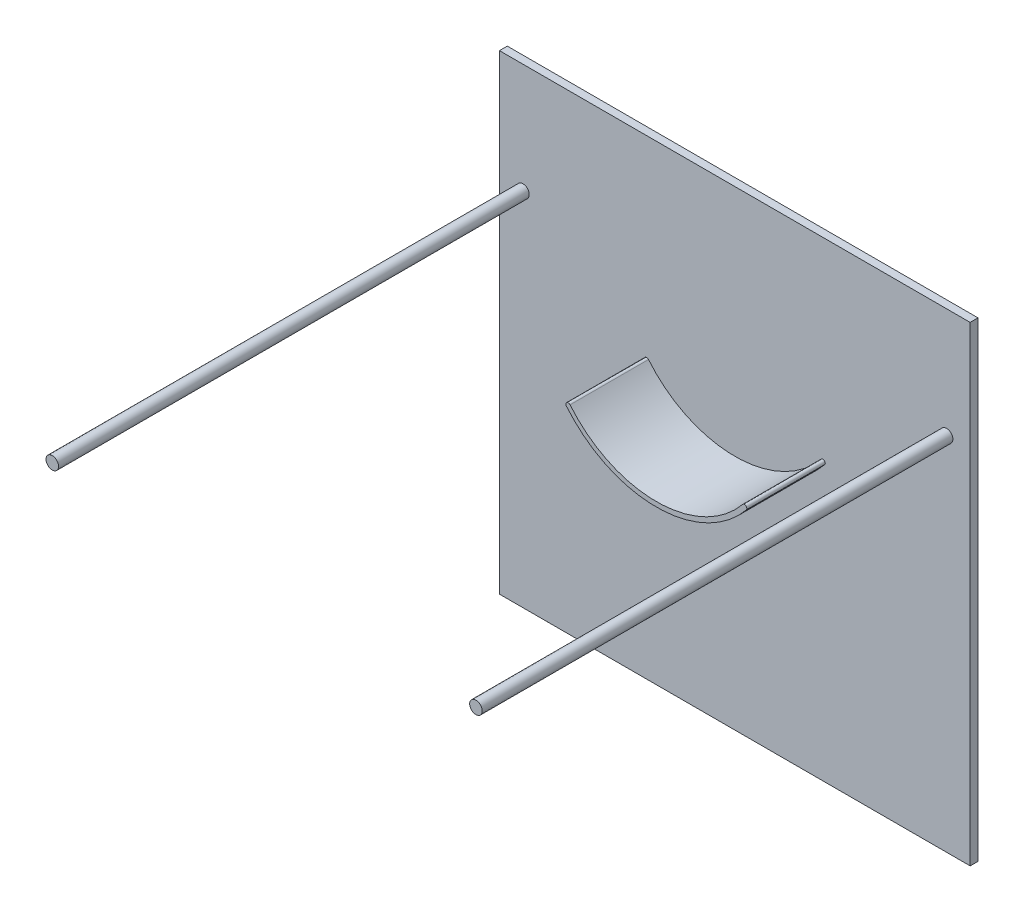
ISO-10303-21;
HEADER;
FILE_DESCRIPTION(('STEP AP214'),'2;1');
FILE_NAME('part.step','',(''),(''),'','','');
FILE_SCHEMA(('AUTOMOTIVE_DESIGN { 1 0 10303 214 1 1 1 1 }'));
ENDSEC;
DATA;
#1=APPLICATION_CONTEXT('core data for automotive mechanical design processes');
#2=APPLICATION_PROTOCOL_DEFINITION('international standard','automotive_design',2000,#1);
#3=PRODUCT_CONTEXT('',#1,'mechanical');
#4=PRODUCT('Part','Part','',(#3));
#5=PRODUCT_RELATED_PRODUCT_CATEGORY('part','',(#4));
#6=PRODUCT_DEFINITION_FORMATION('','',#4);
#7=PRODUCT_DEFINITION_CONTEXT('part definition',#1,'design');
#8=PRODUCT_DEFINITION('design','',#6,#7);
#9=PRODUCT_DEFINITION_SHAPE('','',#8);
#10=(LENGTH_UNIT() NAMED_UNIT(*) SI_UNIT(.MILLI.,.METRE.));
#11=(NAMED_UNIT(*) PLANE_ANGLE_UNIT() SI_UNIT($,.RADIAN.));
#12=(NAMED_UNIT(*) SI_UNIT($,.STERADIAN.) SOLID_ANGLE_UNIT());
#13=UNCERTAINTY_MEASURE_WITH_UNIT(LENGTH_MEASURE(1.E-05),#10,'distance_accuracy_value','');
#14=(GEOMETRIC_REPRESENTATION_CONTEXT(3) GLOBAL_UNCERTAINTY_ASSIGNED_CONTEXT((#13)) GLOBAL_UNIT_ASSIGNED_CONTEXT((#10,
#11,#12)) REPRESENTATION_CONTEXT('',''));
#15=CARTESIAN_POINT('',(0.,0.,0.));
#16=DIRECTION('',(0.,0.,1.));
#17=DIRECTION('',(1.,0.,0.));
#18=AXIS2_PLACEMENT_3D('',#15,#16,#17);
#19=CARTESIAN_POINT('',(0.,0.,5.));
#20=DIRECTION('',(0.,0.,1.));
#21=DIRECTION('',(1.,0.,0.));
#22=AXIS2_PLACEMENT_3D('',#19,#20,#21);
#23=PLANE('',#22);
#24=CARTESIAN_POINT('',(285.,-70.,5.));
#25=DIRECTION('',(0.,0.,1.));
#26=DIRECTION('',(-1.,0.,0.));
#27=AXIS2_PLACEMENT_3D('',#24,#25,#26);
#28=CIRCLE('',#27,4.00000000000005);
#29=CARTESIAN_POINT('',(281.,-70.,5.));
#30=VERTEX_POINT('',#29);
#31=EDGE_CURVE('E134',#30,#30,#28,.T.);
#32=ORIENTED_EDGE('',*,*,#31,.F.);
#33=EDGE_LOOP('',(#32));
#34=FACE_BOUND('',#33,.T.);
#35=CARTESIAN_POINT('',(15.,-70.,5.));
#36=DIRECTION('',(0.,0.,1.));
#37=DIRECTION('',(1.,0.,0.));
#38=AXIS2_PLACEMENT_3D('',#35,#36,#37);
#39=CIRCLE('',#38,4.);
#40=CARTESIAN_POINT('',(19.,-70.,5.));
#41=VERTEX_POINT('',#40);
#42=EDGE_CURVE('E143',#41,#41,#39,.T.);
#43=ORIENTED_EDGE('',*,*,#42,.F.);
#44=EDGE_LOOP('',(#43));
#45=FACE_BOUND('',#44,.T.);
#46=DIRECTION('',(0.,-1.,0.));
#47=VECTOR('',#46,1.);
#48=CARTESIAN_POINT('',(0.,0.,5.));
#49=LINE('',#48,#47);
#50=CARTESIAN_POINT('',(0.,0.,5.));
#51=VERTEX_POINT('',#50);
#52=CARTESIAN_POINT('',(0.,-300.,5.));
#53=VERTEX_POINT('',#52);
#54=EDGE_CURVE('E151',#51,#53,#49,.T.);
#55=ORIENTED_EDGE('',*,*,#54,.T.);
#56=DIRECTION('',(1.,0.,0.));
#57=VECTOR('',#56,1.);
#58=CARTESIAN_POINT('',(0.,-300.,5.));
#59=LINE('',#58,#57);
#60=CARTESIAN_POINT('',(300.,-300.,5.));
#61=VERTEX_POINT('',#60);
#62=EDGE_CURVE('E87',#53,#61,#59,.T.);
#63=ORIENTED_EDGE('',*,*,#62,.T.);
#64=DIRECTION('',(0.,1.,0.));
#65=VECTOR('',#64,1.);
#66=CARTESIAN_POINT('',(300.,0.,5.));
#67=LINE('',#66,#65);
#68=CARTESIAN_POINT('',(300.,0.,5.));
#69=VERTEX_POINT('',#68);
#70=EDGE_CURVE('E154',#61,#69,#67,.T.);
#71=ORIENTED_EDGE('',*,*,#70,.T.);
#72=DIRECTION('',(-1.,0.,0.));
#73=VECTOR('',#72,1.);
#74=CARTESIAN_POINT('',(0.,0.,5.));
#75=LINE('',#74,#73);
#76=EDGE_CURVE('E59',#69,#51,#75,.T.);
#77=ORIENTED_EDGE('',*,*,#76,.T.);
#78=EDGE_LOOP('',(#55,#63,#71,#77));
#79=FACE_BOUND('',#78,.T.);
#80=CARTESIAN_POINT('',(150.,-77.6237471765454,5.));
#81=DIRECTION('',(0.,0.,1.));
#82=DIRECTION('',(1.,0.,0.));
#83=AXIS2_PLACEMENT_3D('',#80,#81,#82);
#84=CIRCLE('',#83,74.2968250462832);
#85=CARTESIAN_POINT('',(92.6857314488704,-124.90051559833,5.));
#86=VERTEX_POINT('',#85);
#87=CARTESIAN_POINT('',(207.31426855113,-124.900515598329,5.));
#88=VERTEX_POINT('',#87);
#89=EDGE_CURVE('E320',#86,#88,#84,.T.);
#90=ORIENTED_EDGE('',*,*,#89,.F.);
#91=CARTESIAN_POINT('',(93.8428657244352,-123.9460313039,5.));
#92=DIRECTION('',(0.,0.,1.));
#93=DIRECTION('',(1.,0.,0.));
#94=AXIS2_PLACEMENT_3D('',#91,#92,#93);
#95=CIRCLE('',#94,1.5);
#96=CARTESIAN_POINT('',(95.,-122.99154700947,5.));
#97=VERTEX_POINT('',#96);
#98=EDGE_CURVE('E132',#97,#86,#95,.T.);
#99=ORIENTED_EDGE('',*,*,#98,.F.);
#100=CARTESIAN_POINT('',(150.,-77.6237471765454,5.));
#101=DIRECTION('',(0.,0.,-1.));
#102=DIRECTION('',(1.,0.,0.));
#103=AXIS2_PLACEMENT_3D('',#100,#101,#102);
#104=CIRCLE('',#103,71.2968250462832);
#105=CARTESIAN_POINT('',(205.,-122.99154700947,5.));
#106=VERTEX_POINT('',#105);
#107=EDGE_CURVE('E128',#106,#97,#104,.T.);
#108=ORIENTED_EDGE('',*,*,#107,.F.);
#109=CARTESIAN_POINT('',(206.157134275565,-123.9460313039,5.));
#110=DIRECTION('',(0.,0.,1.));
#111=DIRECTION('',(-1.,0.,0.));
#112=AXIS2_PLACEMENT_3D('',#109,#110,#111);
#113=CIRCLE('',#112,1.5);
#114=EDGE_CURVE('E317',#88,#106,#113,.T.);
#115=ORIENTED_EDGE('',*,*,#114,.F.);
#116=EDGE_LOOP('',(#90,#99,#108,#115));
#117=FACE_BOUND('',#116,.T.);
#118=ADVANCED_FACE('F35',(#34,#45,#79,#117),#23,.T.);
#119=CARTESIAN_POINT('',(0.,0.,5.));
#120=DIRECTION('',(1.,0.,0.));
#121=DIRECTION('',(0.,1.,0.));
#122=AXIS2_PLACEMENT_3D('',#119,#120,#121);
#123=PLANE('',#122);
#124=DIRECTION('',(0.,-1.,0.));
#125=VECTOR('',#124,1.);
#126=CARTESIAN_POINT('',(0.,0.,0.));
#127=LINE('',#126,#125);
#128=CARTESIAN_POINT('',(0.,0.,0.));
#129=VERTEX_POINT('',#128);
#130=CARTESIAN_POINT('',(0.,-300.,0.));
#131=VERTEX_POINT('',#130);
#132=EDGE_CURVE('E148',#129,#131,#127,.T.);
#133=ORIENTED_EDGE('',*,*,#132,.T.);
#134=DIRECTION('',(0.,0.,-1.));
#135=VECTOR('',#134,1.);
#136=CARTESIAN_POINT('',(0.,-300.,5.));
#137=LINE('',#136,#135);
#138=EDGE_CURVE('E11',#53,#131,#137,.T.);
#139=ORIENTED_EDGE('',*,*,#138,.F.);
#140=ORIENTED_EDGE('',*,*,#54,.F.);
#141=DIRECTION('',(0.,0.,-1.));
#142=VECTOR('',#141,1.);
#143=CARTESIAN_POINT('',(0.,0.,5.));
#144=LINE('',#143,#142);
#145=EDGE_CURVE('E157',#51,#129,#144,.T.);
#146=ORIENTED_EDGE('',*,*,#145,.T.);
#147=EDGE_LOOP('',(#133,#139,#140,#146));
#148=FACE_BOUND('',#147,.T.);
#149=ADVANCED_FACE('F37',(#148),#123,.F.);
#150=CARTESIAN_POINT('',(0.,-300.,5.));
#151=DIRECTION('',(0.,1.,0.));
#152=DIRECTION('',(0.,0.,1.));
#153=AXIS2_PLACEMENT_3D('',#150,#151,#152);
#154=PLANE('',#153);
#155=DIRECTION('',(1.,0.,0.));
#156=VECTOR('',#155,1.);
#157=CARTESIAN_POINT('',(0.,-300.,0.));
#158=LINE('',#157,#156);
#159=CARTESIAN_POINT('',(300.,-300.,0.));
#160=VERTEX_POINT('',#159);
#161=EDGE_CURVE('E160',#131,#160,#158,.T.);
#162=ORIENTED_EDGE('',*,*,#161,.T.);
#163=DIRECTION('',(0.,0.,-1.));
#164=VECTOR('',#163,1.);
#165=CARTESIAN_POINT('',(300.,-300.,5.));
#166=LINE('',#165,#164);
#167=EDGE_CURVE('E43',#61,#160,#166,.T.);
#168=ORIENTED_EDGE('',*,*,#167,.F.);
#169=ORIENTED_EDGE('',*,*,#62,.F.);
#170=ORIENTED_EDGE('',*,*,#138,.T.);
#171=EDGE_LOOP('',(#162,#168,#169,#170));
#172=FACE_BOUND('',#171,.T.);
#173=ADVANCED_FACE('F188',(#172),#154,.F.);
#174=CARTESIAN_POINT('',(300.,0.,5.));
#175=DIRECTION('',(-1.,0.,0.));
#176=DIRECTION('',(0.,-1.,0.));
#177=AXIS2_PLACEMENT_3D('',#174,#175,#176);
#178=PLANE('',#177);
#179=DIRECTION('',(0.,1.,0.));
#180=VECTOR('',#179,1.);
#181=CARTESIAN_POINT('',(300.,0.,0.));
#182=LINE('',#181,#180);
#183=CARTESIAN_POINT('',(300.,0.,0.));
#184=VERTEX_POINT('',#183);
#185=EDGE_CURVE('E162',#160,#184,#182,.T.);
#186=ORIENTED_EDGE('',*,*,#185,.T.);
#187=DIRECTION('',(0.,0.,-1.));
#188=VECTOR('',#187,1.);
#189=CARTESIAN_POINT('',(300.,0.,5.));
#190=LINE('',#189,#188);
#191=EDGE_CURVE('E166',#69,#184,#190,.T.);
#192=ORIENTED_EDGE('',*,*,#191,.F.);
#193=ORIENTED_EDGE('',*,*,#70,.F.);
#194=ORIENTED_EDGE('',*,*,#167,.T.);
#195=EDGE_LOOP('',(#186,#192,#193,#194));
#196=FACE_BOUND('',#195,.T.);
#197=ADVANCED_FACE('F171',(#196),#178,.F.);
#198=CARTESIAN_POINT('',(0.,0.,5.));
#199=DIRECTION('',(0.,-1.,0.));
#200=DIRECTION('',(0.,0.,-1.));
#201=AXIS2_PLACEMENT_3D('',#198,#199,#200);
#202=PLANE('',#201);
#203=DIRECTION('',(-1.,0.,0.));
#204=VECTOR('',#203,1.);
#205=CARTESIAN_POINT('',(0.,0.,0.));
#206=LINE('',#205,#204);
#207=EDGE_CURVE('E80',#184,#129,#206,.T.);
#208=ORIENTED_EDGE('',*,*,#207,.T.);
#209=ORIENTED_EDGE('',*,*,#145,.F.);
#210=ORIENTED_EDGE('',*,*,#76,.F.);
#211=ORIENTED_EDGE('',*,*,#191,.T.);
#212=EDGE_LOOP('',(#208,#209,#210,#211));
#213=FACE_BOUND('',#212,.T.);
#214=ADVANCED_FACE('F179',(#213),#202,.F.);
#215=CARTESIAN_POINT('',(0.,0.,0.));
#216=DIRECTION('',(0.,0.,1.));
#217=DIRECTION('',(1.,0.,0.));
#218=AXIS2_PLACEMENT_3D('',#215,#216,#217);
#219=PLANE('',#218);
#220=ORIENTED_EDGE('',*,*,#132,.F.);
#221=ORIENTED_EDGE('',*,*,#207,.F.);
#222=ORIENTED_EDGE('',*,*,#185,.F.);
#223=ORIENTED_EDGE('',*,*,#161,.F.);
#224=EDGE_LOOP('',(#220,#221,#222,#223));
#225=FACE_BOUND('',#224,.T.);
#226=ADVANCED_FACE('F175',(#225),#219,.F.);
#227=CARTESIAN_POINT('',(15.,-70.,305.));
#228=DIRECTION('',(0.,0.,-1.));
#229=DIRECTION('',(-1.,0.,0.));
#230=AXIS2_PLACEMENT_3D('',#227,#228,#229);
#231=CYLINDRICAL_SURFACE('',#230,4.);
#232=CARTESIAN_POINT('',(15.,-70.,305.));
#233=DIRECTION('',(0.,0.,1.));
#234=DIRECTION('',(1.,0.,0.));
#235=AXIS2_PLACEMENT_3D('',#232,#233,#234);
#236=CIRCLE('',#235,4.);
#237=CARTESIAN_POINT('',(19.,-70.,305.));
#238=VERTEX_POINT('',#237);
#239=EDGE_CURVE('E145',#238,#238,#236,.T.);
#240=ORIENTED_EDGE('',*,*,#239,.F.);
#241=EDGE_LOOP('',(#240));
#242=FACE_BOUND('',#241,.T.);
#243=ORIENTED_EDGE('',*,*,#42,.T.);
#244=EDGE_LOOP('',(#243));
#245=FACE_BOUND('',#244,.T.);
#246=ADVANCED_FACE('F186',(#242,#245),#231,.T.);
#247=CARTESIAN_POINT('',(15.,-70.,305.));
#248=DIRECTION('',(0.,0.,1.));
#249=DIRECTION('',(1.,0.,0.));
#250=AXIS2_PLACEMENT_3D('',#247,#248,#249);
#251=PLANE('',#250);
#252=ORIENTED_EDGE('',*,*,#239,.T.);
#253=EDGE_LOOP('',(#252));
#254=FACE_BOUND('',#253,.T.);
#255=ADVANCED_FACE('F203',(#254),#251,.T.);
#256=CARTESIAN_POINT('',(285.,-70.,305.));
#257=DIRECTION('',(0.,0.,-1.));
#258=DIRECTION('',(-1.,0.,0.));
#259=AXIS2_PLACEMENT_3D('',#256,#257,#258);
#260=CYLINDRICAL_SURFACE('',#259,4.00000000000005);
#261=CARTESIAN_POINT('',(285.,-70.,305.));
#262=DIRECTION('',(0.,0.,1.));
#263=DIRECTION('',(-1.,0.,0.));
#264=AXIS2_PLACEMENT_3D('',#261,#262,#263);
#265=CIRCLE('',#264,4.00000000000005);
#266=CARTESIAN_POINT('',(281.,-70.,305.));
#267=VERTEX_POINT('',#266);
#268=EDGE_CURVE('E137',#267,#267,#265,.T.);
#269=ORIENTED_EDGE('',*,*,#268,.F.);
#270=EDGE_LOOP('',(#269));
#271=FACE_BOUND('',#270,.T.);
#272=ORIENTED_EDGE('',*,*,#31,.T.);
#273=EDGE_LOOP('',(#272));
#274=FACE_BOUND('',#273,.T.);
#275=ADVANCED_FACE('F207',(#271,#274),#260,.T.);
#276=CARTESIAN_POINT('',(285.,-70.,305.));
#277=DIRECTION('',(0.,0.,-1.));
#278=DIRECTION('',(-1.,0.,0.));
#279=AXIS2_PLACEMENT_3D('',#276,#277,#278);
#280=PLANE('',#279);
#281=ORIENTED_EDGE('',*,*,#268,.T.);
#282=EDGE_LOOP('',(#281));
#283=FACE_BOUND('',#282,.T.);
#284=ADVANCED_FACE('F211',(#283),#280,.F.);
#285=CARTESIAN_POINT('',(93.8428657244352,-123.9460313039,55.));
#286=DIRECTION('',(0.,0.,-1.));
#287=DIRECTION('',(-1.,0.,0.));
#288=AXIS2_PLACEMENT_3D('',#285,#286,#287);
#289=CYLINDRICAL_SURFACE('',#288,1.5);
#290=ORIENTED_EDGE('',*,*,#98,.T.);
#291=DIRECTION('',(0.,0.,-1.));
#292=VECTOR('',#291,1.);
#293=CARTESIAN_POINT('',(92.6857314488704,-124.90051559833,55.));
#294=LINE('',#293,#292);
#295=CARTESIAN_POINT('',(92.6857314488704,-124.90051559833,55.));
#296=VERTEX_POINT('',#295);
#297=EDGE_CURVE('E113',#296,#86,#294,.T.);
#298=ORIENTED_EDGE('',*,*,#297,.F.);
#299=CARTESIAN_POINT('',(93.8428657244352,-123.9460313039,55.));
#300=DIRECTION('',(0.,0.,1.));
#301=DIRECTION('',(1.,0.,0.));
#302=AXIS2_PLACEMENT_3D('',#299,#300,#301);
#303=CIRCLE('',#302,1.5);
#304=CARTESIAN_POINT('',(95.,-122.99154700947,55.));
#305=VERTEX_POINT('',#304);
#306=EDGE_CURVE('E120',#305,#296,#303,.T.);
#307=ORIENTED_EDGE('',*,*,#306,.F.);
#308=DIRECTION('',(0.,0.,-1.));
#309=VECTOR('',#308,1.);
#310=CARTESIAN_POINT('',(95.,-122.99154700947,55.));
#311=LINE('',#310,#309);
#312=EDGE_CURVE('E314',#305,#97,#311,.T.);
#313=ORIENTED_EDGE('',*,*,#312,.T.);
#314=EDGE_LOOP('',(#290,#298,#307,#313));
#315=FACE_BOUND('',#314,.T.);
#316=ADVANCED_FACE('F130',(#315),#289,.T.);
#317=CARTESIAN_POINT('',(150.,-77.6237471765454,55.));
#318=DIRECTION('',(0.,0.,-1.));
#319=DIRECTION('',(-1.,0.,0.));
#320=AXIS2_PLACEMENT_3D('',#317,#318,#319);
#321=CYLINDRICAL_SURFACE('',#320,74.2968250462832);
#322=ORIENTED_EDGE('',*,*,#89,.T.);
#323=DIRECTION('',(0.,0.,-1.));
#324=VECTOR('',#323,1.);
#325=CARTESIAN_POINT('',(207.31426855113,-124.900515598329,55.));
#326=LINE('',#325,#324);
#327=CARTESIAN_POINT('',(207.31426855113,-124.900515598329,55.));
#328=VERTEX_POINT('',#327);
#329=EDGE_CURVE('E116',#328,#88,#326,.T.);
#330=ORIENTED_EDGE('',*,*,#329,.F.);
#331=CARTESIAN_POINT('',(150.,-77.6237471765454,55.));
#332=DIRECTION('',(0.,0.,1.));
#333=DIRECTION('',(1.,0.,0.));
#334=AXIS2_PLACEMENT_3D('',#331,#332,#333);
#335=CIRCLE('',#334,74.2968250462832);
#336=EDGE_CURVE('E109',#296,#328,#335,.T.);
#337=ORIENTED_EDGE('',*,*,#336,.F.);
#338=ORIENTED_EDGE('',*,*,#297,.T.);
#339=EDGE_LOOP('',(#322,#330,#337,#338));
#340=FACE_BOUND('',#339,.T.);
#341=ADVANCED_FACE('F111',(#340),#321,.T.);
#342=CARTESIAN_POINT('',(206.157134275565,-123.9460313039,55.));
#343=DIRECTION('',(0.,0.,-1.));
#344=DIRECTION('',(-1.,0.,0.));
#345=AXIS2_PLACEMENT_3D('',#342,#343,#344);
#346=CYLINDRICAL_SURFACE('',#345,1.5);
#347=ORIENTED_EDGE('',*,*,#114,.T.);
#348=DIRECTION('',(0.,0.,-1.));
#349=VECTOR('',#348,1.);
#350=CARTESIAN_POINT('',(205.,-122.99154700947,55.));
#351=LINE('',#350,#349);
#352=CARTESIAN_POINT('',(205.,-122.99154700947,55.));
#353=VERTEX_POINT('',#352);
#354=EDGE_CURVE('E50',#353,#106,#351,.T.);
#355=ORIENTED_EDGE('',*,*,#354,.F.);
#356=CARTESIAN_POINT('',(206.157134275565,-123.9460313039,55.));
#357=DIRECTION('',(0.,0.,1.));
#358=DIRECTION('',(-1.,0.,0.));
#359=AXIS2_PLACEMENT_3D('',#356,#357,#358);
#360=CIRCLE('',#359,1.5);
#361=EDGE_CURVE('E119',#328,#353,#360,.T.);
#362=ORIENTED_EDGE('',*,*,#361,.F.);
#363=ORIENTED_EDGE('',*,*,#329,.T.);
#364=EDGE_LOOP('',(#347,#355,#362,#363));
#365=FACE_BOUND('',#364,.T.);
#366=ADVANCED_FACE('F220',(#365),#346,.T.);
#367=CARTESIAN_POINT('',(150.,-77.6237471765454,55.));
#368=DIRECTION('',(0.,0.,-1.));
#369=DIRECTION('',(-1.,0.,0.));
#370=AXIS2_PLACEMENT_3D('',#367,#368,#369);
#371=CYLINDRICAL_SURFACE('',#370,71.2968250462832);
#372=ORIENTED_EDGE('',*,*,#107,.T.);
#373=ORIENTED_EDGE('',*,*,#312,.F.);
#374=CARTESIAN_POINT('',(150.,-77.6237471765454,55.));
#375=DIRECTION('',(0.,0.,-1.));
#376=DIRECTION('',(1.,0.,0.));
#377=AXIS2_PLACEMENT_3D('',#374,#375,#376);
#378=CIRCLE('',#377,71.2968250462832);
#379=EDGE_CURVE('E124',#353,#305,#378,.T.);
#380=ORIENTED_EDGE('',*,*,#379,.F.);
#381=ORIENTED_EDGE('',*,*,#354,.T.);
#382=EDGE_LOOP('',(#372,#373,#380,#381));
#383=FACE_BOUND('',#382,.T.);
#384=ADVANCED_FACE('F223',(#383),#371,.F.);
#385=CARTESIAN_POINT('',(121.921432862217,-100.784889240223,55.));
#386=DIRECTION('',(0.,0.,1.));
#387=DIRECTION('',(1.,0.,0.));
#388=AXIS2_PLACEMENT_3D('',#385,#386,#387);
#389=PLANE('',#388);
#390=ORIENTED_EDGE('',*,*,#306,.T.);
#391=ORIENTED_EDGE('',*,*,#336,.T.);
#392=ORIENTED_EDGE('',*,*,#361,.T.);
#393=ORIENTED_EDGE('',*,*,#379,.T.);
#394=EDGE_LOOP('',(#390,#391,#392,#393));
#395=FACE_BOUND('',#394,.T.);
#396=ADVANCED_FACE('F123',(#395),#389,.T.);
#397=CLOSED_SHELL('',(#118,#149,#173,#197,#214,#226,#246,#255,#275,#284,#316,#341,#366,#384,#396));
#398=MANIFOLD_SOLID_BREP('B2',#397);
#399=ADVANCED_BREP_SHAPE_REPRESENTATION('',(#18,#398),#14);
#400=SHAPE_DEFINITION_REPRESENTATION(#9,#399);
ENDSEC;
END-ISO-10303-21;
